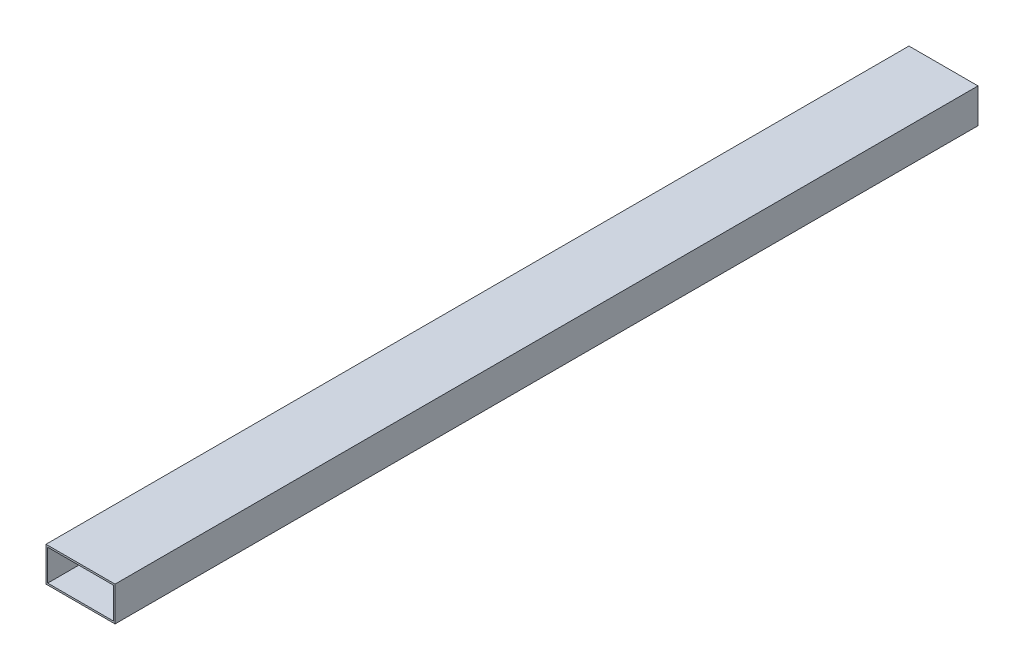
ISO-10303-21;
HEADER;
FILE_DESCRIPTION(('STEP AP214'),'2;1');
FILE_NAME('part.step','',(''),(''),'','','');
FILE_SCHEMA(('AUTOMOTIVE_DESIGN { 1 0 10303 214 1 1 1 1 }'));
ENDSEC;
DATA;
#1=APPLICATION_CONTEXT('core data for automotive mechanical design processes');
#2=APPLICATION_PROTOCOL_DEFINITION('international standard','automotive_design',2000,#1);
#3=PRODUCT_CONTEXT('',#1,'mechanical');
#4=PRODUCT('Part','Part','',(#3));
#5=PRODUCT_RELATED_PRODUCT_CATEGORY('part','',(#4));
#6=PRODUCT_DEFINITION_FORMATION('','',#4);
#7=PRODUCT_DEFINITION_CONTEXT('part definition',#1,'design');
#8=PRODUCT_DEFINITION('design','',#6,#7);
#9=PRODUCT_DEFINITION_SHAPE('','',#8);
#10=(LENGTH_UNIT() NAMED_UNIT(*) SI_UNIT(.MILLI.,.METRE.));
#11=(NAMED_UNIT(*) PLANE_ANGLE_UNIT() SI_UNIT($,.RADIAN.));
#12=(NAMED_UNIT(*) SI_UNIT($,.STERADIAN.) SOLID_ANGLE_UNIT());
#13=UNCERTAINTY_MEASURE_WITH_UNIT(LENGTH_MEASURE(1.E-05),#10,'distance_accuracy_value','');
#14=(GEOMETRIC_REPRESENTATION_CONTEXT(3) GLOBAL_UNCERTAINTY_ASSIGNED_CONTEXT((#13)) GLOBAL_UNIT_ASSIGNED_CONTEXT((#10,
#11,#12)) REPRESENTATION_CONTEXT('',''));
#15=CARTESIAN_POINT('',(0.,0.,0.));
#16=DIRECTION('',(0.,0.,1.));
#17=DIRECTION('',(1.,0.,0.));
#18=AXIS2_PLACEMENT_3D('',#15,#16,#17);
#19=CARTESIAN_POINT('',(-20.,-10.,500.));
#20=DIRECTION('',(1.,0.,0.));
#21=DIRECTION('',(0.,0.,-1.));
#22=AXIS2_PLACEMENT_3D('',#19,#20,#21);
#23=PLANE('',#22);
#24=DIRECTION('',(0.,-1.,0.));
#25=VECTOR('',#24,1.);
#26=CARTESIAN_POINT('',(-20.,-10.,0.));
#27=LINE('',#26,#25);
#28=CARTESIAN_POINT('',(-20.,10.,0.));
#29=VERTEX_POINT('',#28);
#30=CARTESIAN_POINT('',(-20.,-10.,0.));
#31=VERTEX_POINT('',#30);
#32=EDGE_CURVE('E147',#29,#31,#27,.T.);
#33=ORIENTED_EDGE('',*,*,#32,.T.);
#34=DIRECTION('',(0.,0.,-1.));
#35=VECTOR('',#34,1.);
#36=CARTESIAN_POINT('',(-20.,-10.,500.));
#37=LINE('',#36,#35);
#38=CARTESIAN_POINT('',(-20.,-10.,500.));
#39=VERTEX_POINT('',#38);
#40=EDGE_CURVE('E11',#39,#31,#37,.T.);
#41=ORIENTED_EDGE('',*,*,#40,.F.);
#42=DIRECTION('',(0.,-1.,0.));
#43=VECTOR('',#42,1.);
#44=CARTESIAN_POINT('',(-20.,-10.,500.));
#45=LINE('',#44,#43);
#46=CARTESIAN_POINT('',(-20.,10.,500.));
#47=VERTEX_POINT('',#46);
#48=EDGE_CURVE('E153',#47,#39,#45,.T.);
#49=ORIENTED_EDGE('',*,*,#48,.F.);
#50=DIRECTION('',(0.,0.,-1.));
#51=VECTOR('',#50,1.);
#52=CARTESIAN_POINT('',(-20.,10.,500.));
#53=LINE('',#52,#51);
#54=EDGE_CURVE('E167',#47,#29,#53,.T.);
#55=ORIENTED_EDGE('',*,*,#54,.T.);
#56=EDGE_LOOP('',(#33,#41,#49,#55));
#57=FACE_BOUND('',#56,.T.);
#58=ADVANCED_FACE('F39',(#57),#23,.F.);
#59=CARTESIAN_POINT('',(20.,-10.,500.));
#60=DIRECTION('',(0.,1.,0.));
#61=DIRECTION('',(0.,0.,1.));
#62=AXIS2_PLACEMENT_3D('',#59,#60,#61);
#63=PLANE('',#62);
#64=DIRECTION('',(1.,0.,0.));
#65=VECTOR('',#64,1.);
#66=CARTESIAN_POINT('',(20.,-10.,0.));
#67=LINE('',#66,#65);
#68=CARTESIAN_POINT('',(20.,-10.,0.));
#69=VERTEX_POINT('',#68);
#70=EDGE_CURVE('E171',#31,#69,#67,.T.);
#71=ORIENTED_EDGE('',*,*,#70,.T.);
#72=DIRECTION('',(0.,0.,-1.));
#73=VECTOR('',#72,1.);
#74=CARTESIAN_POINT('',(20.,-10.,500.));
#75=LINE('',#74,#73);
#76=CARTESIAN_POINT('',(20.,-10.,500.));
#77=VERTEX_POINT('',#76);
#78=EDGE_CURVE('E47',#77,#69,#75,.T.);
#79=ORIENTED_EDGE('',*,*,#78,.F.);
#80=DIRECTION('',(1.,0.,0.));
#81=VECTOR('',#80,1.);
#82=CARTESIAN_POINT('',(20.,-10.,500.));
#83=LINE('',#82,#81);
#84=EDGE_CURVE('E157',#39,#77,#83,.T.);
#85=ORIENTED_EDGE('',*,*,#84,.F.);
#86=ORIENTED_EDGE('',*,*,#40,.T.);
#87=EDGE_LOOP('',(#71,#79,#85,#86));
#88=FACE_BOUND('',#87,.T.);
#89=ADVANCED_FACE('F205',(#88),#63,.F.);
#90=CARTESIAN_POINT('',(20.,10.,500.));
#91=DIRECTION('',(-1.,0.,0.));
#92=DIRECTION('',(0.,0.,1.));
#93=AXIS2_PLACEMENT_3D('',#90,#91,#92);
#94=PLANE('',#93);
#95=DIRECTION('',(0.,1.,0.));
#96=VECTOR('',#95,1.);
#97=CARTESIAN_POINT('',(20.,10.,0.));
#98=LINE('',#97,#96);
#99=CARTESIAN_POINT('',(20.,10.,0.));
#100=VERTEX_POINT('',#99);
#101=EDGE_CURVE('E174',#69,#100,#98,.T.);
#102=ORIENTED_EDGE('',*,*,#101,.T.);
#103=DIRECTION('',(0.,0.,-1.));
#104=VECTOR('',#103,1.);
#105=CARTESIAN_POINT('',(20.,10.,500.));
#106=LINE('',#105,#104);
#107=CARTESIAN_POINT('',(20.,10.,500.));
#108=VERTEX_POINT('',#107);
#109=EDGE_CURVE('E182',#108,#100,#106,.T.);
#110=ORIENTED_EDGE('',*,*,#109,.F.);
#111=DIRECTION('',(0.,1.,0.));
#112=VECTOR('',#111,1.);
#113=CARTESIAN_POINT('',(20.,10.,500.));
#114=LINE('',#113,#112);
#115=EDGE_CURVE('E161',#77,#108,#114,.T.);
#116=ORIENTED_EDGE('',*,*,#115,.F.);
#117=ORIENTED_EDGE('',*,*,#78,.T.);
#118=EDGE_LOOP('',(#102,#110,#116,#117));
#119=FACE_BOUND('',#118,.T.);
#120=ADVANCED_FACE('F191',(#119),#94,.F.);
#121=CARTESIAN_POINT('',(-20.,10.,500.));
#122=DIRECTION('',(0.,-1.,0.));
#123=DIRECTION('',(0.,0.,-1.));
#124=AXIS2_PLACEMENT_3D('',#121,#122,#123);
#125=PLANE('',#124);
#126=DIRECTION('',(-1.,0.,0.));
#127=VECTOR('',#126,1.);
#128=CARTESIAN_POINT('',(-20.,10.,0.));
#129=LINE('',#128,#127);
#130=EDGE_CURVE('E158',#100,#29,#129,.T.);
#131=ORIENTED_EDGE('',*,*,#130,.T.);
#132=ORIENTED_EDGE('',*,*,#54,.F.);
#133=DIRECTION('',(-1.,0.,0.));
#134=VECTOR('',#133,1.);
#135=CARTESIAN_POINT('',(-20.,10.,500.));
#136=LINE('',#135,#134);
#137=EDGE_CURVE('E164',#108,#47,#136,.T.);
#138=ORIENTED_EDGE('',*,*,#137,.F.);
#139=ORIENTED_EDGE('',*,*,#109,.T.);
#140=EDGE_LOOP('',(#131,#132,#138,#139));
#141=FACE_BOUND('',#140,.T.);
#142=ADVANCED_FACE('F198',(#141),#125,.F.);
#143=CARTESIAN_POINT('',(0.,0.,500.));
#144=DIRECTION('',(0.,0.,-1.));
#145=DIRECTION('',(-1.,0.,0.));
#146=AXIS2_PLACEMENT_3D('',#143,#144,#145);
#147=PLANE('',#146);
#148=DIRECTION('',(0.,-1.,0.));
#149=VECTOR('',#148,1.);
#150=CARTESIAN_POINT('',(-19.,9.,500.));
#151=LINE('',#150,#149);
#152=CARTESIAN_POINT('',(-19.,9.,500.));
#153=VERTEX_POINT('',#152);
#154=CARTESIAN_POINT('',(-19.,-9.,500.));
#155=VERTEX_POINT('',#154);
#156=EDGE_CURVE('E138',#153,#155,#151,.T.);
#157=ORIENTED_EDGE('',*,*,#156,.F.);
#158=DIRECTION('',(-1.,0.,0.));
#159=VECTOR('',#158,1.);
#160=CARTESIAN_POINT('',(19.,9.,500.));
#161=LINE('',#160,#159);
#162=CARTESIAN_POINT('',(19.,9.,500.));
#163=VERTEX_POINT('',#162);
#164=EDGE_CURVE('E54',#163,#153,#161,.T.);
#165=ORIENTED_EDGE('',*,*,#164,.F.);
#166=DIRECTION('',(0.,1.,0.));
#167=VECTOR('',#166,1.);
#168=CARTESIAN_POINT('',(19.,-9.,500.));
#169=LINE('',#168,#167);
#170=CARTESIAN_POINT('',(19.,-9.,500.));
#171=VERTEX_POINT('',#170);
#172=EDGE_CURVE('E125',#171,#163,#169,.T.);
#173=ORIENTED_EDGE('',*,*,#172,.F.);
#174=DIRECTION('',(1.,0.,0.));
#175=VECTOR('',#174,1.);
#176=CARTESIAN_POINT('',(-19.,-9.,500.));
#177=LINE('',#176,#175);
#178=EDGE_CURVE('E129',#155,#171,#177,.T.);
#179=ORIENTED_EDGE('',*,*,#178,.F.);
#180=EDGE_LOOP('',(#157,#165,#173,#179));
#181=FACE_BOUND('',#180,.T.);
#182=ORIENTED_EDGE('',*,*,#48,.T.);
#183=ORIENTED_EDGE('',*,*,#84,.T.);
#184=ORIENTED_EDGE('',*,*,#115,.T.);
#185=ORIENTED_EDGE('',*,*,#137,.T.);
#186=EDGE_LOOP('',(#182,#183,#184,#185));
#187=FACE_BOUND('',#186,.T.);
#188=ADVANCED_FACE('F204',(#181,#187),#147,.F.);
#189=CARTESIAN_POINT('',(0.,0.,0.));
#190=DIRECTION('',(0.,0.,-1.));
#191=DIRECTION('',(-1.,0.,0.));
#192=AXIS2_PLACEMENT_3D('',#189,#190,#191);
#193=PLANE('',#192);
#194=DIRECTION('',(-1.,0.,0.));
#195=VECTOR('',#194,1.);
#196=CARTESIAN_POINT('',(19.,9.,0.));
#197=LINE('',#196,#195);
#198=CARTESIAN_POINT('',(19.,9.,0.));
#199=VERTEX_POINT('',#198);
#200=CARTESIAN_POINT('',(-19.,9.,0.));
#201=VERTEX_POINT('',#200);
#202=EDGE_CURVE('E106',#199,#201,#197,.T.);
#203=ORIENTED_EDGE('',*,*,#202,.T.);
#204=DIRECTION('',(0.,-1.,0.));
#205=VECTOR('',#204,1.);
#206=CARTESIAN_POINT('',(-19.,9.,0.));
#207=LINE('',#206,#205);
#208=CARTESIAN_POINT('',(-19.,-9.,0.));
#209=VERTEX_POINT('',#208);
#210=EDGE_CURVE('E116',#201,#209,#207,.T.);
#211=ORIENTED_EDGE('',*,*,#210,.T.);
#212=DIRECTION('',(1.,0.,0.));
#213=VECTOR('',#212,1.);
#214=CARTESIAN_POINT('',(-19.,-9.,0.));
#215=LINE('',#214,#213);
#216=CARTESIAN_POINT('',(19.,-9.,0.));
#217=VERTEX_POINT('',#216);
#218=EDGE_CURVE('E62',#209,#217,#215,.T.);
#219=ORIENTED_EDGE('',*,*,#218,.T.);
#220=DIRECTION('',(0.,1.,0.));
#221=VECTOR('',#220,1.);
#222=CARTESIAN_POINT('',(19.,-9.,0.));
#223=LINE('',#222,#221);
#224=EDGE_CURVE('E113',#217,#199,#223,.T.);
#225=ORIENTED_EDGE('',*,*,#224,.T.);
#226=EDGE_LOOP('',(#203,#211,#219,#225));
#227=FACE_BOUND('',#226,.T.);
#228=ORIENTED_EDGE('',*,*,#32,.F.);
#229=ORIENTED_EDGE('',*,*,#130,.F.);
#230=ORIENTED_EDGE('',*,*,#101,.F.);
#231=ORIENTED_EDGE('',*,*,#70,.F.);
#232=EDGE_LOOP('',(#228,#229,#230,#231));
#233=FACE_BOUND('',#232,.T.);
#234=ADVANCED_FACE('F121',(#227,#233),#193,.T.);
#235=CARTESIAN_POINT('',(19.,9.,0.));
#236=DIRECTION('',(0.,1.,0.));
#237=DIRECTION('',(0.,0.,1.));
#238=AXIS2_PLACEMENT_3D('',#235,#236,#237);
#239=PLANE('',#238);
#240=ORIENTED_EDGE('',*,*,#164,.T.);
#241=DIRECTION('',(0.,0.,1.));
#242=VECTOR('',#241,1.);
#243=CARTESIAN_POINT('',(-19.,9.,0.));
#244=LINE('',#243,#242);
#245=EDGE_CURVE('E102',#201,#153,#244,.T.);
#246=ORIENTED_EDGE('',*,*,#245,.F.);
#247=ORIENTED_EDGE('',*,*,#202,.F.);
#248=DIRECTION('',(0.,0.,1.));
#249=VECTOR('',#248,1.);
#250=CARTESIAN_POINT('',(19.,9.,0.));
#251=LINE('',#250,#249);
#252=EDGE_CURVE('E144',#199,#163,#251,.T.);
#253=ORIENTED_EDGE('',*,*,#252,.T.);
#254=EDGE_LOOP('',(#240,#246,#247,#253));
#255=FACE_BOUND('',#254,.T.);
#256=ADVANCED_FACE('F104',(#255),#239,.F.);
#257=CARTESIAN_POINT('',(19.,-9.,0.));
#258=DIRECTION('',(1.,0.,0.));
#259=DIRECTION('',(0.,0.,-1.));
#260=AXIS2_PLACEMENT_3D('',#257,#258,#259);
#261=PLANE('',#260);
#262=ORIENTED_EDGE('',*,*,#172,.T.);
#263=ORIENTED_EDGE('',*,*,#252,.F.);
#264=ORIENTED_EDGE('',*,*,#224,.F.);
#265=DIRECTION('',(0.,0.,1.));
#266=VECTOR('',#265,1.);
#267=CARTESIAN_POINT('',(19.,-9.,0.));
#268=LINE('',#267,#266);
#269=EDGE_CURVE('E148',#217,#171,#268,.T.);
#270=ORIENTED_EDGE('',*,*,#269,.T.);
#271=EDGE_LOOP('',(#262,#263,#264,#270));
#272=FACE_BOUND('',#271,.T.);
#273=ADVANCED_FACE('F222',(#272),#261,.F.);
#274=CARTESIAN_POINT('',(-19.,-9.,0.));
#275=DIRECTION('',(0.,-1.,0.));
#276=DIRECTION('',(0.,0.,-1.));
#277=AXIS2_PLACEMENT_3D('',#274,#275,#276);
#278=PLANE('',#277);
#279=ORIENTED_EDGE('',*,*,#178,.T.);
#280=ORIENTED_EDGE('',*,*,#269,.F.);
#281=ORIENTED_EDGE('',*,*,#218,.F.);
#282=DIRECTION('',(0.,0.,1.));
#283=VECTOR('',#282,1.);
#284=CARTESIAN_POINT('',(-19.,-9.,0.));
#285=LINE('',#284,#283);
#286=EDGE_CURVE('E112',#209,#155,#285,.T.);
#287=ORIENTED_EDGE('',*,*,#286,.T.);
#288=EDGE_LOOP('',(#279,#280,#281,#287));
#289=FACE_BOUND('',#288,.T.);
#290=ADVANCED_FACE('F225',(#289),#278,.F.);
#291=CARTESIAN_POINT('',(-19.,9.,0.));
#292=DIRECTION('',(-1.,0.,0.));
#293=DIRECTION('',(0.,0.,1.));
#294=AXIS2_PLACEMENT_3D('',#291,#292,#293);
#295=PLANE('',#294);
#296=ORIENTED_EDGE('',*,*,#156,.T.);
#297=ORIENTED_EDGE('',*,*,#286,.F.);
#298=ORIENTED_EDGE('',*,*,#210,.F.);
#299=ORIENTED_EDGE('',*,*,#245,.T.);
#300=EDGE_LOOP('',(#296,#297,#298,#299));
#301=FACE_BOUND('',#300,.T.);
#302=ADVANCED_FACE('F117',(#301),#295,.F.);
#303=CLOSED_SHELL('',(#58,#89,#120,#142,#188,#234,#256,#273,#290,#302));
#304=MANIFOLD_SOLID_BREP('B2',#303);
#305=ADVANCED_BREP_SHAPE_REPRESENTATION('',(#18,#304),#14);
#306=SHAPE_DEFINITION_REPRESENTATION(#9,#305);
ENDSEC;
END-ISO-10303-21;
